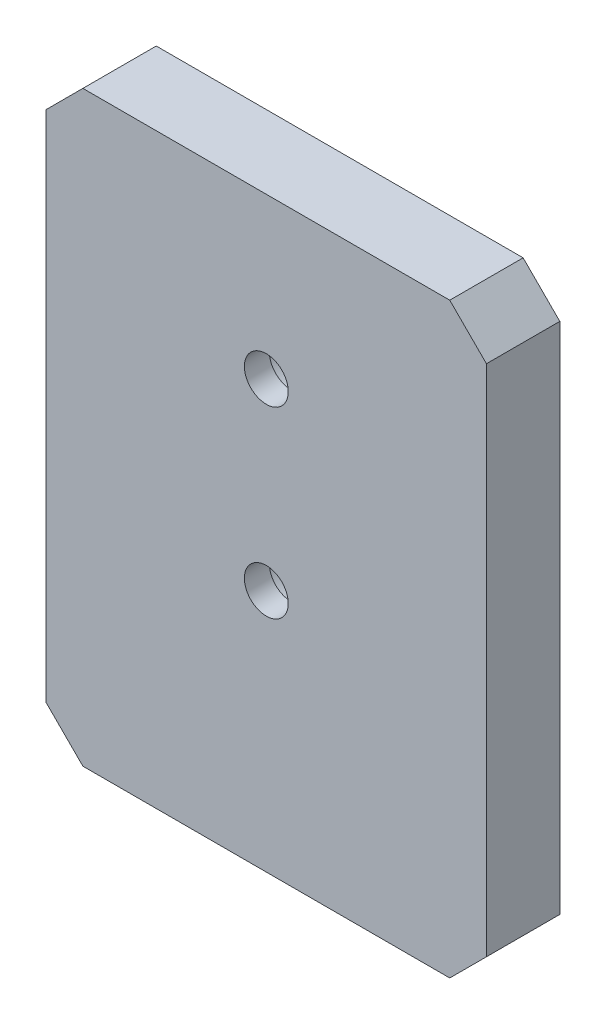
ISO-10303-21;
HEADER;
FILE_DESCRIPTION(('STEP AP214'),'2;1');
FILE_NAME('part.step','',(''),(''),'','','');
FILE_SCHEMA(('AUTOMOTIVE_DESIGN { 1 0 10303 214 1 1 1 1 }'));
ENDSEC;
DATA;
#1=APPLICATION_CONTEXT('core data for automotive mechanical design processes');
#2=APPLICATION_PROTOCOL_DEFINITION('international standard','automotive_design',2000,#1);
#3=PRODUCT_CONTEXT('',#1,'mechanical');
#4=PRODUCT('Part','Part','',(#3));
#5=PRODUCT_RELATED_PRODUCT_CATEGORY('part','',(#4));
#6=PRODUCT_DEFINITION_FORMATION('','',#4);
#7=PRODUCT_DEFINITION_CONTEXT('part definition',#1,'design');
#8=PRODUCT_DEFINITION('design','',#6,#7);
#9=PRODUCT_DEFINITION_SHAPE('','',#8);
#10=(LENGTH_UNIT() NAMED_UNIT(*) SI_UNIT(.MILLI.,.METRE.));
#11=(NAMED_UNIT(*) PLANE_ANGLE_UNIT() SI_UNIT($,.RADIAN.));
#12=(NAMED_UNIT(*) SI_UNIT($,.STERADIAN.) SOLID_ANGLE_UNIT());
#13=UNCERTAINTY_MEASURE_WITH_UNIT(LENGTH_MEASURE(1.E-05),#10,'distance_accuracy_value','');
#14=(GEOMETRIC_REPRESENTATION_CONTEXT(3) GLOBAL_UNCERTAINTY_ASSIGNED_CONTEXT((#13)) GLOBAL_UNIT_ASSIGNED_CONTEXT((#10,
#11,#12)) REPRESENTATION_CONTEXT('',''));
#15=CARTESIAN_POINT('',(0.,0.,0.));
#16=DIRECTION('',(0.,0.,1.));
#17=DIRECTION('',(1.,0.,0.));
#18=AXIS2_PLACEMENT_3D('',#15,#16,#17);
#19=CARTESIAN_POINT('',(19.05,-25.4,-6.35));
#20=DIRECTION('',(1.,0.,0.));
#21=DIRECTION('',(0.,0.,-1.));
#22=AXIS2_PLACEMENT_3D('',#19,#20,#21);
#23=PLANE('',#22);
#24=DIRECTION('',(0.,1.,0.));
#25=VECTOR('',#24,1.);
#26=CARTESIAN_POINT('',(19.05,-25.4,0.));
#27=LINE('',#26,#25);
#28=CARTESIAN_POINT('',(19.05,-22.225,0.));
#29=VERTEX_POINT('',#28);
#30=CARTESIAN_POINT('',(19.05,22.225,0.));
#31=VERTEX_POINT('',#30);
#32=EDGE_CURVE('E170',#29,#31,#27,.T.);
#33=ORIENTED_EDGE('',*,*,#32,.F.);
#34=DIRECTION('',(0.,0.,-1.));
#35=VECTOR('',#34,1.);
#36=CARTESIAN_POINT('',(19.05,-22.225,-6.35));
#37=LINE('',#36,#35);
#38=CARTESIAN_POINT('',(19.05,-22.225,-6.35));
#39=VERTEX_POINT('',#38);
#40=EDGE_CURVE('E161',#29,#39,#37,.T.);
#41=ORIENTED_EDGE('',*,*,#40,.T.);
#42=DIRECTION('',(0.,1.,0.));
#43=VECTOR('',#42,1.);
#44=CARTESIAN_POINT('',(19.05,-25.4,-6.35));
#45=LINE('',#44,#43);
#46=CARTESIAN_POINT('',(19.05,22.225,-6.35));
#47=VERTEX_POINT('',#46);
#48=EDGE_CURVE('E167',#39,#47,#45,.T.);
#49=ORIENTED_EDGE('',*,*,#48,.T.);
#50=DIRECTION('',(0.,0.,1.));
#51=VECTOR('',#50,1.);
#52=CARTESIAN_POINT('',(19.05,22.225,-6.35));
#53=LINE('',#52,#51);
#54=EDGE_CURVE('E158',#47,#31,#53,.T.);
#55=ORIENTED_EDGE('',*,*,#54,.T.);
#56=EDGE_LOOP('',(#33,#41,#49,#55));
#57=FACE_BOUND('',#56,.T.);
#58=ADVANCED_FACE('F46',(#57),#23,.T.);
#59=CARTESIAN_POINT('',(-19.05,-25.4,-6.35));
#60=DIRECTION('',(0.,-1.,0.));
#61=DIRECTION('',(0.,0.,-1.));
#62=AXIS2_PLACEMENT_3D('',#59,#60,#61);
#63=PLANE('',#62);
#64=DIRECTION('',(1.,0.,0.));
#65=VECTOR('',#64,1.);
#66=CARTESIAN_POINT('',(-19.05,-25.4,0.));
#67=LINE('',#66,#65);
#68=CARTESIAN_POINT('',(-15.875,-25.4,0.));
#69=VERTEX_POINT('',#68);
#70=CARTESIAN_POINT('',(15.875,-25.4,0.));
#71=VERTEX_POINT('',#70);
#72=EDGE_CURVE('E131',#69,#71,#67,.T.);
#73=ORIENTED_EDGE('',*,*,#72,.F.);
#74=DIRECTION('',(0.,0.,-1.));
#75=VECTOR('',#74,1.);
#76=CARTESIAN_POINT('',(-15.875,-25.4,-6.35));
#77=LINE('',#76,#75);
#78=CARTESIAN_POINT('',(-15.875,-25.4,-6.35));
#79=VERTEX_POINT('',#78);
#80=EDGE_CURVE('E149',#69,#79,#77,.T.);
#81=ORIENTED_EDGE('',*,*,#80,.T.);
#82=DIRECTION('',(1.,0.,0.));
#83=VECTOR('',#82,1.);
#84=CARTESIAN_POINT('',(-19.05,-25.4,-6.35));
#85=LINE('',#84,#83);
#86=CARTESIAN_POINT('',(15.875,-25.4,-6.35));
#87=VERTEX_POINT('',#86);
#88=EDGE_CURVE('E134',#79,#87,#85,.T.);
#89=ORIENTED_EDGE('',*,*,#88,.T.);
#90=DIRECTION('',(0.,0.,1.));
#91=VECTOR('',#90,1.);
#92=CARTESIAN_POINT('',(15.875,-25.4,-6.35));
#93=LINE('',#92,#91);
#94=EDGE_CURVE('E146',#87,#71,#93,.T.);
#95=ORIENTED_EDGE('',*,*,#94,.T.);
#96=EDGE_LOOP('',(#73,#81,#89,#95));
#97=FACE_BOUND('',#96,.T.);
#98=ADVANCED_FACE('F183',(#97),#63,.T.);
#99=CARTESIAN_POINT('',(-19.05,-25.4,-6.35));
#100=DIRECTION('',(-1.,0.,0.));
#101=DIRECTION('',(0.,0.,1.));
#102=AXIS2_PLACEMENT_3D('',#99,#100,#101);
#103=PLANE('',#102);
#104=DIRECTION('',(0.,-1.,0.));
#105=VECTOR('',#104,1.);
#106=CARTESIAN_POINT('',(-19.05,-25.4,-6.35));
#107=LINE('',#106,#105);
#108=CARTESIAN_POINT('',(-19.05,22.225,-6.35));
#109=VERTEX_POINT('',#108);
#110=CARTESIAN_POINT('',(-19.05,-22.225,-6.35));
#111=VERTEX_POINT('',#110);
#112=EDGE_CURVE('E138',#109,#111,#107,.T.);
#113=ORIENTED_EDGE('',*,*,#112,.T.);
#114=DIRECTION('',(0.,0.,1.));
#115=VECTOR('',#114,1.);
#116=CARTESIAN_POINT('',(-19.05,-22.225,-6.35));
#117=LINE('',#116,#115);
#118=CARTESIAN_POINT('',(-19.05,-22.225,0.));
#119=VERTEX_POINT('',#118);
#120=EDGE_CURVE('E130',#111,#119,#117,.T.);
#121=ORIENTED_EDGE('',*,*,#120,.T.);
#122=DIRECTION('',(0.,-1.,0.));
#123=VECTOR('',#122,1.);
#124=CARTESIAN_POINT('',(-19.05,-25.4,0.));
#125=LINE('',#124,#123);
#126=CARTESIAN_POINT('',(-19.05,22.225,0.));
#127=VERTEX_POINT('',#126);
#128=EDGE_CURVE('E116',#127,#119,#125,.T.);
#129=ORIENTED_EDGE('',*,*,#128,.F.);
#130=DIRECTION('',(0.,0.,-1.));
#131=VECTOR('',#130,1.);
#132=CARTESIAN_POINT('',(-19.05,22.225,-6.35));
#133=LINE('',#132,#131);
#134=EDGE_CURVE('E128',#127,#109,#133,.T.);
#135=ORIENTED_EDGE('',*,*,#134,.T.);
#136=EDGE_LOOP('',(#113,#121,#129,#135));
#137=FACE_BOUND('',#136,.T.);
#138=ADVANCED_FACE('F127',(#137),#103,.T.);
#139=CARTESIAN_POINT('',(-19.05,25.4,-6.35));
#140=DIRECTION('',(0.,1.,0.));
#141=DIRECTION('',(0.,0.,1.));
#142=AXIS2_PLACEMENT_3D('',#139,#140,#141);
#143=PLANE('',#142);
#144=DIRECTION('',(-1.,0.,0.));
#145=VECTOR('',#144,1.);
#146=CARTESIAN_POINT('',(-19.05,25.4,-6.35));
#147=LINE('',#146,#145);
#148=CARTESIAN_POINT('',(15.875,25.4,-6.35));
#149=VERTEX_POINT('',#148);
#150=CARTESIAN_POINT('',(-15.875,25.4,-6.35));
#151=VERTEX_POINT('',#150);
#152=EDGE_CURVE('E176',#149,#151,#147,.T.);
#153=ORIENTED_EDGE('',*,*,#152,.T.);
#154=DIRECTION('',(0.,0.,1.));
#155=VECTOR('',#154,1.);
#156=CARTESIAN_POINT('',(-15.875,25.4,-6.35));
#157=LINE('',#156,#155);
#158=CARTESIAN_POINT('',(-15.875,25.4,0.));
#159=VERTEX_POINT('',#158);
#160=EDGE_CURVE('E11',#151,#159,#157,.T.);
#161=ORIENTED_EDGE('',*,*,#160,.T.);
#162=DIRECTION('',(-1.,0.,0.));
#163=VECTOR('',#162,1.);
#164=CARTESIAN_POINT('',(-19.05,25.4,0.));
#165=LINE('',#164,#163);
#166=CARTESIAN_POINT('',(15.875,25.4,0.));
#167=VERTEX_POINT('',#166);
#168=EDGE_CURVE('E117',#167,#159,#165,.T.);
#169=ORIENTED_EDGE('',*,*,#168,.F.);
#170=DIRECTION('',(0.,0.,-1.));
#171=VECTOR('',#170,1.);
#172=CARTESIAN_POINT('',(15.875,25.4,-6.35));
#173=LINE('',#172,#171);
#174=EDGE_CURVE('E55',#167,#149,#173,.T.);
#175=ORIENTED_EDGE('',*,*,#174,.T.);
#176=EDGE_LOOP('',(#153,#161,#169,#175));
#177=FACE_BOUND('',#176,.T.);
#178=ADVANCED_FACE('F224',(#177),#143,.T.);
#179=CARTESIAN_POINT('',(0.,0.,-6.35));
#180=DIRECTION('',(0.,0.,-1.));
#181=DIRECTION('',(-1.,0.,0.));
#182=AXIS2_PLACEMENT_3D('',#179,#180,#181);
#183=PLANE('',#182);
#184=CARTESIAN_POINT('',(0.,-4.31800000000004,-6.35));
#185=DIRECTION('',(0.,0.,-1.));
#186=DIRECTION('',(-1.,0.,0.));
#187=AXIS2_PLACEMENT_3D('',#184,#185,#186);
#188=CIRCLE('',#187,3.57251);
#189=CARTESIAN_POINT('',(-3.57251,-4.31800000000004,-6.35));
#190=VERTEX_POINT('',#189);
#191=EDGE_CURVE('E216',#190,#190,#188,.T.);
#192=ORIENTED_EDGE('',*,*,#191,.F.);
#193=EDGE_LOOP('',(#192));
#194=FACE_BOUND('',#193,.T.);
#195=CARTESIAN_POINT('',(0.,11.557,-6.35));
#196=DIRECTION('',(0.,0.,-1.));
#197=DIRECTION('',(-1.,0.,0.));
#198=AXIS2_PLACEMENT_3D('',#195,#196,#197);
#199=CIRCLE('',#198,3.57251);
#200=CARTESIAN_POINT('',(-3.57251,11.557,-6.35));
#201=VERTEX_POINT('',#200);
#202=EDGE_CURVE('E204',#201,#201,#199,.T.);
#203=ORIENTED_EDGE('',*,*,#202,.F.);
#204=EDGE_LOOP('',(#203));
#205=FACE_BOUND('',#204,.T.);
#206=ORIENTED_EDGE('',*,*,#88,.F.);
#207=DIRECTION('',(0.707106781186548,-0.707106781186547,0.));
#208=VECTOR('',#207,1.);
#209=CARTESIAN_POINT('',(-20.6375,-20.6375,-6.35));
#210=LINE('',#209,#208);
#211=EDGE_CURVE('E156',#79,#111,#210,.F.);
#212=ORIENTED_EDGE('',*,*,#211,.T.);
#213=ORIENTED_EDGE('',*,*,#112,.F.);
#214=DIRECTION('',(-0.707106781186546,-0.707106781186549,0.));
#215=VECTOR('',#214,1.);
#216=CARTESIAN_POINT('',(-20.6375,20.6374999999999,-6.35));
#217=LINE('',#216,#215);
#218=EDGE_CURVE('E62',#109,#151,#217,.F.);
#219=ORIENTED_EDGE('',*,*,#218,.T.);
#220=ORIENTED_EDGE('',*,*,#152,.F.);
#221=DIRECTION('',(-0.707106781186549,0.707106781186546,0.));
#222=VECTOR('',#221,1.);
#223=CARTESIAN_POINT('',(20.6375,20.6375000000001,-6.35));
#224=LINE('',#223,#222);
#225=EDGE_CURVE('E151',#149,#47,#224,.F.);
#226=ORIENTED_EDGE('',*,*,#225,.T.);
#227=ORIENTED_EDGE('',*,*,#48,.F.);
#228=DIRECTION('',(0.707106781186546,0.707106781186549,0.));
#229=VECTOR('',#228,1.);
#230=CARTESIAN_POINT('',(20.6375,-20.6374999999999,-6.35));
#231=LINE('',#230,#229);
#232=EDGE_CURVE('E154',#39,#87,#231,.F.);
#233=ORIENTED_EDGE('',*,*,#232,.T.);
#234=EDGE_LOOP('',(#206,#212,#213,#219,#220,#226,#227,#233));
#235=FACE_BOUND('',#234,.T.);
#236=ADVANCED_FACE('F174',(#194,#205,#235),#183,.T.);
#237=CARTESIAN_POINT('',(0.,0.,0.));
#238=DIRECTION('',(0.,0.,-1.));
#239=DIRECTION('',(-1.,0.,0.));
#240=AXIS2_PLACEMENT_3D('',#237,#238,#239);
#241=PLANE('',#240);
#242=CARTESIAN_POINT('',(0.,-4.31800000000004,0.));
#243=DIRECTION('',(0.,0.,-1.));
#244=DIRECTION('',(-1.,0.,0.));
#245=AXIS2_PLACEMENT_3D('',#242,#243,#244);
#246=CIRCLE('',#245,1.89865);
#247=CARTESIAN_POINT('',(-1.89865,-4.31800000000004,0.));
#248=VERTEX_POINT('',#247);
#249=EDGE_CURVE('E207',#248,#248,#246,.T.);
#250=ORIENTED_EDGE('',*,*,#249,.T.);
#251=EDGE_LOOP('',(#250));
#252=FACE_BOUND('',#251,.T.);
#253=CARTESIAN_POINT('',(0.,11.557,0.));
#254=DIRECTION('',(0.,0.,-1.));
#255=DIRECTION('',(-1.,0.,0.));
#256=AXIS2_PLACEMENT_3D('',#253,#254,#255);
#257=CIRCLE('',#256,1.89865);
#258=CARTESIAN_POINT('',(-1.89865,11.557,0.));
#259=VERTEX_POINT('',#258);
#260=EDGE_CURVE('E192',#259,#259,#257,.T.);
#261=ORIENTED_EDGE('',*,*,#260,.T.);
#262=EDGE_LOOP('',(#261));
#263=FACE_BOUND('',#262,.T.);
#264=ORIENTED_EDGE('',*,*,#128,.T.);
#265=DIRECTION('',(-0.707106781186548,0.707106781186547,0.));
#266=VECTOR('',#265,1.);
#267=CARTESIAN_POINT('',(-19.05,-22.225,0.));
#268=LINE('',#267,#266);
#269=EDGE_CURVE('E144',#119,#69,#268,.F.);
#270=ORIENTED_EDGE('',*,*,#269,.T.);
#271=ORIENTED_EDGE('',*,*,#72,.T.);
#272=DIRECTION('',(-0.707106781186546,-0.707106781186549,0.));
#273=VECTOR('',#272,1.);
#274=CARTESIAN_POINT('',(15.875,-25.4,0.));
#275=LINE('',#274,#273);
#276=EDGE_CURVE('E121',#71,#29,#275,.F.);
#277=ORIENTED_EDGE('',*,*,#276,.T.);
#278=ORIENTED_EDGE('',*,*,#32,.T.);
#279=DIRECTION('',(0.707106781186549,-0.707106781186546,0.));
#280=VECTOR('',#279,1.);
#281=CARTESIAN_POINT('',(19.05,22.225,0.));
#282=LINE('',#281,#280);
#283=EDGE_CURVE('E122',#31,#167,#282,.F.);
#284=ORIENTED_EDGE('',*,*,#283,.T.);
#285=ORIENTED_EDGE('',*,*,#168,.T.);
#286=DIRECTION('',(0.707106781186546,0.707106781186549,0.));
#287=VECTOR('',#286,1.);
#288=CARTESIAN_POINT('',(-15.875,25.4,0.));
#289=LINE('',#288,#287);
#290=EDGE_CURVE('E113',#159,#127,#289,.F.);
#291=ORIENTED_EDGE('',*,*,#290,.T.);
#292=EDGE_LOOP('',(#264,#270,#271,#277,#278,#284,#285,#291));
#293=FACE_BOUND('',#292,.T.);
#294=ADVANCED_FACE('F115',(#252,#263,#293),#241,.F.);
#295=CARTESIAN_POINT('',(-19.05,-22.225,-6.35));
#296=DIRECTION('',(0.707106781186547,0.707106781186548,0.));
#297=DIRECTION('',(0.,0.,1.));
#298=AXIS2_PLACEMENT_3D('',#295,#296,#297);
#299=PLANE('',#298);
#300=ORIENTED_EDGE('',*,*,#211,.F.);
#301=ORIENTED_EDGE('',*,*,#80,.F.);
#302=ORIENTED_EDGE('',*,*,#269,.F.);
#303=ORIENTED_EDGE('',*,*,#120,.F.);
#304=EDGE_LOOP('',(#300,#301,#302,#303));
#305=FACE_BOUND('',#304,.T.);
#306=ADVANCED_FACE('F187',(#305),#299,.F.);
#307=CARTESIAN_POINT('',(15.875,-25.4,-6.35));
#308=DIRECTION('',(-0.707106781186549,0.707106781186546,0.));
#309=DIRECTION('',(0.,0.,1.));
#310=AXIS2_PLACEMENT_3D('',#307,#308,#309);
#311=PLANE('',#310);
#312=ORIENTED_EDGE('',*,*,#232,.F.);
#313=ORIENTED_EDGE('',*,*,#40,.F.);
#314=ORIENTED_EDGE('',*,*,#276,.F.);
#315=ORIENTED_EDGE('',*,*,#94,.F.);
#316=EDGE_LOOP('',(#312,#313,#314,#315));
#317=FACE_BOUND('',#316,.T.);
#318=ADVANCED_FACE('F179',(#317),#311,.F.);
#319=CARTESIAN_POINT('',(-15.875,25.4,-6.35));
#320=DIRECTION('',(0.707106781186549,-0.707106781186546,0.));
#321=DIRECTION('',(0.,0.,1.));
#322=AXIS2_PLACEMENT_3D('',#319,#320,#321);
#323=PLANE('',#322);
#324=ORIENTED_EDGE('',*,*,#218,.F.);
#325=ORIENTED_EDGE('',*,*,#134,.F.);
#326=ORIENTED_EDGE('',*,*,#290,.F.);
#327=ORIENTED_EDGE('',*,*,#160,.F.);
#328=EDGE_LOOP('',(#324,#325,#326,#327));
#329=FACE_BOUND('',#328,.T.);
#330=ADVANCED_FACE('F133',(#329),#323,.F.);
#331=CARTESIAN_POINT('',(19.05,22.225,-6.35));
#332=DIRECTION('',(-0.707106781186546,-0.707106781186549,0.));
#333=DIRECTION('',(0.,0.,1.));
#334=AXIS2_PLACEMENT_3D('',#331,#332,#333);
#335=PLANE('',#334);
#336=ORIENTED_EDGE('',*,*,#225,.F.);
#337=ORIENTED_EDGE('',*,*,#174,.F.);
#338=ORIENTED_EDGE('',*,*,#283,.F.);
#339=ORIENTED_EDGE('',*,*,#54,.F.);
#340=EDGE_LOOP('',(#336,#337,#338,#339));
#341=FACE_BOUND('',#340,.T.);
#342=ADVANCED_FACE('F49',(#341),#335,.F.);
#343=CARTESIAN_POINT('',(0.,11.557,-6.35));
#344=DIRECTION('',(0.,0.,-1.));
#345=DIRECTION('',(-1.,0.,0.));
#346=AXIS2_PLACEMENT_3D('',#343,#344,#345);
#347=CYLINDRICAL_SURFACE('',#346,1.89865);
#348=ORIENTED_EDGE('',*,*,#260,.F.);
#349=EDGE_LOOP('',(#348));
#350=FACE_BOUND('',#349,.T.);
#351=CARTESIAN_POINT('',(0.,11.557,-2.159));
#352=DIRECTION('',(0.,0.,-1.));
#353=DIRECTION('',(-1.,0.,0.));
#354=AXIS2_PLACEMENT_3D('',#351,#352,#353);
#355=CIRCLE('',#354,1.89865);
#356=CARTESIAN_POINT('',(-1.89865,11.557,-2.159));
#357=VERTEX_POINT('',#356);
#358=EDGE_CURVE('E194',#357,#357,#355,.T.);
#359=ORIENTED_EDGE('',*,*,#358,.T.);
#360=EDGE_LOOP('',(#359));
#361=FACE_BOUND('',#360,.T.);
#362=ADVANCED_FACE('F241',(#350,#361),#347,.F.);
#363=CARTESIAN_POINT('',(1.89865,11.557,-2.159));
#364=DIRECTION('',(0.,0.,1.));
#365=DIRECTION('',(1.,0.,0.));
#366=AXIS2_PLACEMENT_3D('',#363,#364,#365);
#367=PLANE('',#366);
#368=ORIENTED_EDGE('',*,*,#358,.F.);
#369=EDGE_LOOP('',(#368));
#370=FACE_BOUND('',#369,.T.);
#371=CARTESIAN_POINT('',(0.,11.557,-2.159));
#372=DIRECTION('',(0.,0.,-1.));
#373=DIRECTION('',(-1.,0.,0.));
#374=AXIS2_PLACEMENT_3D('',#371,#372,#373);
#375=CIRCLE('',#374,3.57251);
#376=CARTESIAN_POINT('',(-3.57251,11.557,-2.159));
#377=VERTEX_POINT('',#376);
#378=EDGE_CURVE('E199',#377,#377,#375,.T.);
#379=ORIENTED_EDGE('',*,*,#378,.T.);
#380=EDGE_LOOP('',(#379));
#381=FACE_BOUND('',#380,.T.);
#382=ADVANCED_FACE('F231',(#370,#381),#367,.F.);
#383=CARTESIAN_POINT('',(0.,11.557,-6.35));
#384=DIRECTION('',(0.,0.,-1.));
#385=DIRECTION('',(-1.,0.,0.));
#386=AXIS2_PLACEMENT_3D('',#383,#384,#385);
#387=CYLINDRICAL_SURFACE('',#386,3.57251);
#388=ORIENTED_EDGE('',*,*,#378,.F.);
#389=EDGE_LOOP('',(#388));
#390=FACE_BOUND('',#389,.T.);
#391=ORIENTED_EDGE('',*,*,#202,.T.);
#392=EDGE_LOOP('',(#391));
#393=FACE_BOUND('',#392,.T.);
#394=ADVANCED_FACE('F228',(#390,#393),#387,.F.);
#395=CARTESIAN_POINT('',(0.,-4.31800000000004,-6.35));
#396=DIRECTION('',(0.,0.,-1.));
#397=DIRECTION('',(-1.,0.,0.));
#398=AXIS2_PLACEMENT_3D('',#395,#396,#397);
#399=CYLINDRICAL_SURFACE('',#398,1.89865);
#400=ORIENTED_EDGE('',*,*,#249,.F.);
#401=EDGE_LOOP('',(#400));
#402=FACE_BOUND('',#401,.T.);
#403=CARTESIAN_POINT('',(0.,-4.31800000000004,-2.159));
#404=DIRECTION('',(0.,0.,-1.));
#405=DIRECTION('',(-1.,0.,0.));
#406=AXIS2_PLACEMENT_3D('',#403,#404,#405);
#407=CIRCLE('',#406,1.89865);
#408=CARTESIAN_POINT('',(-1.89865,-4.31800000000004,-2.159));
#409=VERTEX_POINT('',#408);
#410=EDGE_CURVE('E210',#409,#409,#407,.T.);
#411=ORIENTED_EDGE('',*,*,#410,.T.);
#412=EDGE_LOOP('',(#411));
#413=FACE_BOUND('',#412,.T.);
#414=ADVANCED_FACE('F230',(#402,#413),#399,.F.);
#415=CARTESIAN_POINT('',(1.89865,-4.31800000000004,-2.159));
#416=DIRECTION('',(0.,0.,1.));
#417=DIRECTION('',(1.,0.,0.));
#418=AXIS2_PLACEMENT_3D('',#415,#416,#417);
#419=PLANE('',#418);
#420=ORIENTED_EDGE('',*,*,#410,.F.);
#421=EDGE_LOOP('',(#420));
#422=FACE_BOUND('',#421,.T.);
#423=CARTESIAN_POINT('',(0.,-4.31800000000004,-2.159));
#424=DIRECTION('',(0.,0.,-1.));
#425=DIRECTION('',(-1.,0.,0.));
#426=AXIS2_PLACEMENT_3D('',#423,#424,#425);
#427=CIRCLE('',#426,3.57251);
#428=CARTESIAN_POINT('',(-3.57251,-4.31800000000004,-2.159));
#429=VERTEX_POINT('',#428);
#430=EDGE_CURVE('E213',#429,#429,#427,.T.);
#431=ORIENTED_EDGE('',*,*,#430,.T.);
#432=EDGE_LOOP('',(#431));
#433=FACE_BOUND('',#432,.T.);
#434=ADVANCED_FACE('F238',(#422,#433),#419,.F.);
#435=CARTESIAN_POINT('',(0.,-4.31800000000004,-6.35));
#436=DIRECTION('',(0.,0.,-1.));
#437=DIRECTION('',(-1.,0.,0.));
#438=AXIS2_PLACEMENT_3D('',#435,#436,#437);
#439=CYLINDRICAL_SURFACE('',#438,3.57251);
#440=ORIENTED_EDGE('',*,*,#430,.F.);
#441=EDGE_LOOP('',(#440));
#442=FACE_BOUND('',#441,.T.);
#443=ORIENTED_EDGE('',*,*,#191,.T.);
#444=EDGE_LOOP('',(#443));
#445=FACE_BOUND('',#444,.T.);
#446=ADVANCED_FACE('F220',(#442,#445),#439,.F.);
#447=CLOSED_SHELL('',(#58,#98,#138,#178,#236,#294,#306,#318,#330,#342,#362,#382,#394,#414,#434,#446));
#448=MANIFOLD_SOLID_BREP('B2',#447);
#449=ADVANCED_BREP_SHAPE_REPRESENTATION('',(#18,#448),#14);
#450=SHAPE_DEFINITION_REPRESENTATION(#9,#449);
ENDSEC;
END-ISO-10303-21;
